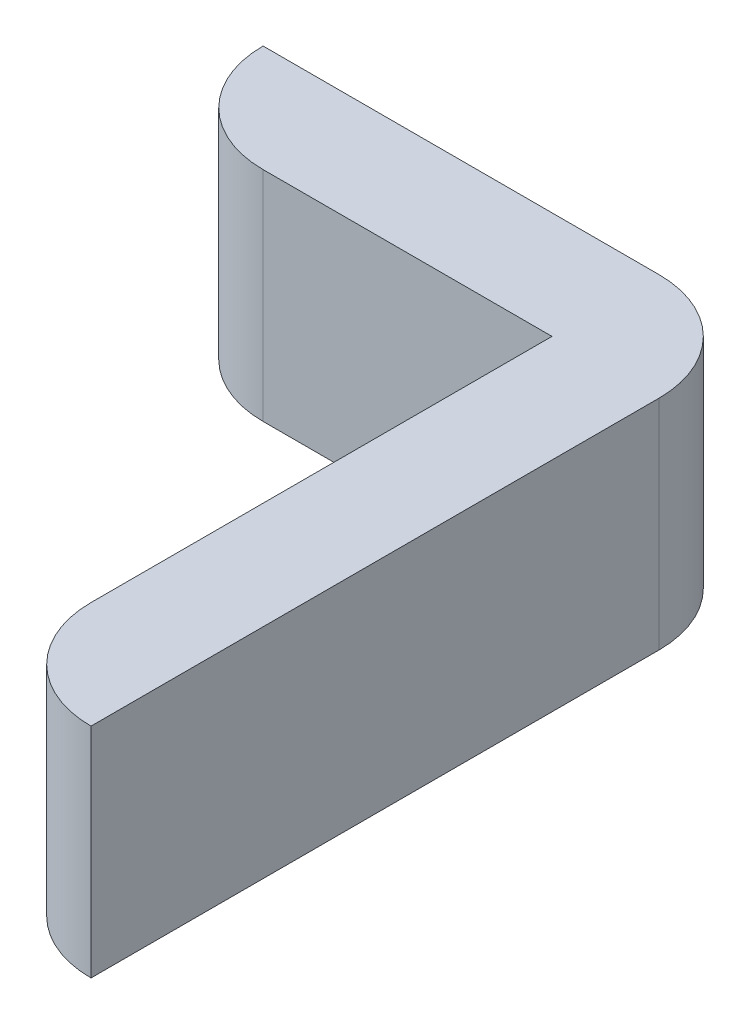
ISO-10303-21;
HEADER;
FILE_DESCRIPTION(('STEP AP214'),'2;1');
FILE_NAME('part.step','',(''),(''),'','','');
FILE_SCHEMA(('AUTOMOTIVE_DESIGN { 1 0 10303 214 1 1 1 1 }'));
ENDSEC;
DATA;
#1=APPLICATION_CONTEXT('core data for automotive mechanical design processes');
#2=APPLICATION_PROTOCOL_DEFINITION('international standard','automotive_design',2000,#1);
#3=PRODUCT_CONTEXT('',#1,'mechanical');
#4=PRODUCT('Part','Part','',(#3));
#5=PRODUCT_RELATED_PRODUCT_CATEGORY('part','',(#4));
#6=PRODUCT_DEFINITION_FORMATION('','',#4);
#7=PRODUCT_DEFINITION_CONTEXT('part definition',#1,'design');
#8=PRODUCT_DEFINITION('design','',#6,#7);
#9=PRODUCT_DEFINITION_SHAPE('','',#8);
#10=(LENGTH_UNIT() NAMED_UNIT(*) SI_UNIT(.MILLI.,.METRE.));
#11=(NAMED_UNIT(*) PLANE_ANGLE_UNIT() SI_UNIT($,.RADIAN.));
#12=(NAMED_UNIT(*) SI_UNIT($,.STERADIAN.) SOLID_ANGLE_UNIT());
#13=UNCERTAINTY_MEASURE_WITH_UNIT(LENGTH_MEASURE(1.E-05),#10,'distance_accuracy_value','');
#14=(GEOMETRIC_REPRESENTATION_CONTEXT(3) GLOBAL_UNCERTAINTY_ASSIGNED_CONTEXT((#13)) GLOBAL_UNIT_ASSIGNED_CONTEXT((#10,
#11,#12)) REPRESENTATION_CONTEXT('',''));
#15=CARTESIAN_POINT('',(0.,0.,0.));
#16=DIRECTION('',(0.,0.,1.));
#17=DIRECTION('',(1.,0.,0.));
#18=AXIS2_PLACEMENT_3D('',#15,#16,#17);
#19=CARTESIAN_POINT('',(-0.125,7.8748,0.));
#20=DIRECTION('',(0.,-1.,0.));
#21=DIRECTION('',(0.,0.,-1.));
#22=AXIS2_PLACEMENT_3D('',#19,#20,#21);
#23=PLANE('',#22);
#24=DIRECTION('',(-1.,0.,0.));
#25=VECTOR('',#24,1.);
#26=CARTESIAN_POINT('',(0.125,7.8748,0.25));
#27=LINE('',#26,#25);
#28=CARTESIAN_POINT('',(0.125,7.8748,0.25));
#29=VERTEX_POINT('',#28);
#30=CARTESIAN_POINT('',(0.8,7.8748,0.25));
#31=VERTEX_POINT('',#30);
#32=EDGE_CURVE('E102',#29,#31,#27,.F.);
#33=ORIENTED_EDGE('',*,*,#32,.T.);
#34=DIRECTION('',(0.,0.,-1.));
#35=VECTOR('',#34,1.);
#36=CARTESIAN_POINT('',(0.8,7.8748,0.25));
#37=LINE('',#36,#35);
#38=CARTESIAN_POINT('',(0.8,7.8748,1.327));
#39=VERTEX_POINT('',#38);
#40=EDGE_CURVE('E108',#31,#39,#37,.F.);
#41=ORIENTED_EDGE('',*,*,#40,.T.);
#42=CARTESIAN_POINT('',(1.05,7.8748,1.327));
#43=DIRECTION('',(0.,-1.,0.));
#44=DIRECTION('',(0.,0.,-1.));
#45=AXIS2_PLACEMENT_3D('',#42,#43,#44);
#46=CIRCLE('',#45,0.25);
#47=CARTESIAN_POINT('',(1.05,7.8748,1.577));
#48=VERTEX_POINT('',#47);
#49=EDGE_CURVE('E80',#48,#39,#46,.T.);
#50=ORIENTED_EDGE('',*,*,#49,.F.);
#51=DIRECTION('',(0.,0.,1.));
#52=VECTOR('',#51,1.);
#53=CARTESIAN_POINT('',(1.05,7.8748,1.577));
#54=LINE('',#53,#52);
#55=CARTESIAN_POINT('',(1.05,7.8748,0.25));
#56=VERTEX_POINT('',#55);
#57=EDGE_CURVE('E75',#48,#56,#54,.F.);
#58=ORIENTED_EDGE('',*,*,#57,.T.);
#59=CARTESIAN_POINT('',(0.8,7.8748,0.25));
#60=DIRECTION('',(0.,-1.,0.));
#61=DIRECTION('',(0.,0.,-1.));
#62=AXIS2_PLACEMENT_3D('',#59,#60,#61);
#63=CIRCLE('',#62,0.25);
#64=CARTESIAN_POINT('',(0.8,7.8748,0.));
#65=VERTEX_POINT('',#64);
#66=EDGE_CURVE('E19',#65,#56,#63,.T.);
#67=ORIENTED_EDGE('',*,*,#66,.F.);
#68=DIRECTION('',(1.,0.,0.));
#69=VECTOR('',#68,1.);
#70=CARTESIAN_POINT('',(0.8,7.8748,0.));
#71=LINE('',#70,#69);
#72=CARTESIAN_POINT('',(-0.125,7.8748,0.));
#73=VERTEX_POINT('',#72);
#74=EDGE_CURVE('E70',#65,#73,#71,.F.);
#75=ORIENTED_EDGE('',*,*,#74,.T.);
#76=CARTESIAN_POINT('',(0.125,7.8748,0.));
#77=DIRECTION('',(0.,-1.,0.));
#78=DIRECTION('',(0.,0.,-1.));
#79=AXIS2_PLACEMENT_3D('',#76,#77,#78);
#80=CIRCLE('',#79,0.25);
#81=EDGE_CURVE('E121',#29,#73,#80,.T.);
#82=ORIENTED_EDGE('',*,*,#81,.F.);
#83=EDGE_LOOP('',(#33,#41,#50,#58,#67,#75,#82));
#84=FACE_BOUND('',#83,.T.);
#85=ADVANCED_FACE('F16',(#84),#23,.F.);
#86=CARTESIAN_POINT('',(0.8,7.3652,0.));
#87=DIRECTION('',(0.,0.,1.));
#88=DIRECTION('',(1.,0.,0.));
#89=AXIS2_PLACEMENT_3D('',#86,#87,#88);
#90=PLANE('',#89);
#91=DIRECTION('',(0.,-1.,0.));
#92=VECTOR('',#91,1.);
#93=CARTESIAN_POINT('',(-0.125,7.3652,0.));
#94=LINE('',#93,#92);
#95=CARTESIAN_POINT('',(-0.125,7.3652,0.));
#96=VERTEX_POINT('',#95);
#97=EDGE_CURVE('E123',#73,#96,#94,.T.);
#98=ORIENTED_EDGE('',*,*,#97,.F.);
#99=ORIENTED_EDGE('',*,*,#74,.F.);
#100=DIRECTION('',(0.,-1.,0.));
#101=VECTOR('',#100,1.);
#102=CARTESIAN_POINT('',(0.8,7.3652,0.));
#103=LINE('',#102,#101);
#104=CARTESIAN_POINT('',(0.8,7.3652,0.));
#105=VERTEX_POINT('',#104);
#106=EDGE_CURVE('E92',#105,#65,#103,.F.);
#107=ORIENTED_EDGE('',*,*,#106,.F.);
#108=DIRECTION('',(1.,0.,0.));
#109=VECTOR('',#108,1.);
#110=CARTESIAN_POINT('',(-0.125,7.3652,0.));
#111=LINE('',#110,#109);
#112=EDGE_CURVE('E120',#96,#105,#111,.T.);
#113=ORIENTED_EDGE('',*,*,#112,.F.);
#114=EDGE_LOOP('',(#98,#99,#107,#113));
#115=FACE_BOUND('',#114,.T.);
#116=ADVANCED_FACE('F158',(#115),#90,.F.);
#117=CARTESIAN_POINT('',(0.8,7.3652,0.25));
#118=DIRECTION('',(0.,-1.,0.));
#119=DIRECTION('',(0.,0.,-1.));
#120=AXIS2_PLACEMENT_3D('',#117,#118,#119);
#121=CYLINDRICAL_SURFACE('',#120,0.25);
#122=ORIENTED_EDGE('',*,*,#66,.T.);
#123=DIRECTION('',(0.,1.,0.));
#124=VECTOR('',#123,1.);
#125=CARTESIAN_POINT('',(1.05,7.3652,0.25));
#126=LINE('',#125,#124);
#127=CARTESIAN_POINT('',(1.05,7.3652,0.25));
#128=VERTEX_POINT('',#127);
#129=EDGE_CURVE('E86',#56,#128,#126,.F.);
#130=ORIENTED_EDGE('',*,*,#129,.T.);
#131=CARTESIAN_POINT('',(0.8,7.3652,0.25));
#132=DIRECTION('',(0.,-1.,0.));
#133=DIRECTION('',(0.,0.,-1.));
#134=AXIS2_PLACEMENT_3D('',#131,#132,#133);
#135=CIRCLE('',#134,0.25);
#136=EDGE_CURVE('E118',#105,#128,#135,.T.);
#137=ORIENTED_EDGE('',*,*,#136,.F.);
#138=ORIENTED_EDGE('',*,*,#106,.T.);
#139=EDGE_LOOP('',(#122,#130,#137,#138));
#140=FACE_BOUND('',#139,.T.);
#141=ADVANCED_FACE('F89',(#140),#121,.T.);
#142=CARTESIAN_POINT('',(1.05,7.3652,1.577));
#143=DIRECTION('',(-1.,0.,0.));
#144=DIRECTION('',(0.,0.,1.));
#145=AXIS2_PLACEMENT_3D('',#142,#143,#144);
#146=PLANE('',#145);
#147=DIRECTION('',(0.,-1.,0.));
#148=VECTOR('',#147,1.);
#149=CARTESIAN_POINT('',(1.05,7.3652,1.577));
#150=LINE('',#149,#148);
#151=CARTESIAN_POINT('',(1.05,7.3652,1.577));
#152=VERTEX_POINT('',#151);
#153=EDGE_CURVE('E85',#152,#48,#150,.F.);
#154=ORIENTED_EDGE('',*,*,#153,.F.);
#155=DIRECTION('',(0.,0.,-1.));
#156=VECTOR('',#155,1.);
#157=CARTESIAN_POINT('',(1.05,7.3652,0.));
#158=LINE('',#157,#156);
#159=EDGE_CURVE('E94',#128,#152,#158,.F.);
#160=ORIENTED_EDGE('',*,*,#159,.F.);
#161=ORIENTED_EDGE('',*,*,#129,.F.);
#162=ORIENTED_EDGE('',*,*,#57,.F.);
#163=EDGE_LOOP('',(#154,#160,#161,#162));
#164=FACE_BOUND('',#163,.T.);
#165=ADVANCED_FACE('F93',(#164),#146,.F.);
#166=CARTESIAN_POINT('',(1.05,7.3652,1.327));
#167=DIRECTION('',(0.,-1.,0.));
#168=DIRECTION('',(0.,0.,-1.));
#169=AXIS2_PLACEMENT_3D('',#166,#167,#168);
#170=CYLINDRICAL_SURFACE('',#169,0.25);
#171=ORIENTED_EDGE('',*,*,#49,.T.);
#172=DIRECTION('',(0.,1.,0.));
#173=VECTOR('',#172,1.);
#174=CARTESIAN_POINT('',(0.8,7.3652,1.327));
#175=LINE('',#174,#173);
#176=CARTESIAN_POINT('',(0.8,7.3652,1.327));
#177=VERTEX_POINT('',#176);
#178=EDGE_CURVE('E105',#39,#177,#175,.F.);
#179=ORIENTED_EDGE('',*,*,#178,.T.);
#180=CARTESIAN_POINT('',(1.05,7.3652,1.327));
#181=DIRECTION('',(0.,-1.,0.));
#182=DIRECTION('',(0.,0.,-1.));
#183=AXIS2_PLACEMENT_3D('',#180,#181,#182);
#184=CIRCLE('',#183,0.25);
#185=EDGE_CURVE('E114',#152,#177,#184,.T.);
#186=ORIENTED_EDGE('',*,*,#185,.F.);
#187=ORIENTED_EDGE('',*,*,#153,.T.);
#188=EDGE_LOOP('',(#171,#179,#186,#187));
#189=FACE_BOUND('',#188,.T.);
#190=ADVANCED_FACE('F127',(#189),#170,.T.);
#191=CARTESIAN_POINT('',(0.8,7.3652,0.25));
#192=DIRECTION('',(1.,0.,0.));
#193=DIRECTION('',(0.,0.,-1.));
#194=AXIS2_PLACEMENT_3D('',#191,#192,#193);
#195=PLANE('',#194);
#196=ORIENTED_EDGE('',*,*,#178,.F.);
#197=ORIENTED_EDGE('',*,*,#40,.F.);
#198=DIRECTION('',(0.,1.,0.));
#199=VECTOR('',#198,1.);
#200=CARTESIAN_POINT('',(0.8,7.3652,0.25));
#201=LINE('',#200,#199);
#202=CARTESIAN_POINT('',(0.8,7.3652,0.25));
#203=VERTEX_POINT('',#202);
#204=EDGE_CURVE('E104',#31,#203,#201,.F.);
#205=ORIENTED_EDGE('',*,*,#204,.T.);
#206=DIRECTION('',(0.,0.,-1.));
#207=VECTOR('',#206,1.);
#208=CARTESIAN_POINT('',(0.8,7.3652,0.));
#209=LINE('',#208,#207);
#210=EDGE_CURVE('E117',#177,#203,#209,.T.);
#211=ORIENTED_EDGE('',*,*,#210,.F.);
#212=EDGE_LOOP('',(#196,#197,#205,#211));
#213=FACE_BOUND('',#212,.T.);
#214=ADVANCED_FACE('F150',(#213),#195,.F.);
#215=CARTESIAN_POINT('',(0.125,7.3652,0.25));
#216=DIRECTION('',(0.,0.,-1.));
#217=DIRECTION('',(-1.,0.,0.));
#218=AXIS2_PLACEMENT_3D('',#215,#216,#217);
#219=PLANE('',#218);
#220=ORIENTED_EDGE('',*,*,#204,.F.);
#221=ORIENTED_EDGE('',*,*,#32,.F.);
#222=DIRECTION('',(0.,-1.,0.));
#223=VECTOR('',#222,1.);
#224=CARTESIAN_POINT('',(0.125,7.3652,0.25));
#225=LINE('',#224,#223);
#226=CARTESIAN_POINT('',(0.125,7.3652,0.25));
#227=VERTEX_POINT('',#226);
#228=EDGE_CURVE('E34',#227,#29,#225,.F.);
#229=ORIENTED_EDGE('',*,*,#228,.F.);
#230=DIRECTION('',(1.,0.,0.));
#231=VECTOR('',#230,1.);
#232=CARTESIAN_POINT('',(-0.125,7.3652,0.25));
#233=LINE('',#232,#231);
#234=EDGE_CURVE('E25',#203,#227,#233,.F.);
#235=ORIENTED_EDGE('',*,*,#234,.F.);
#236=EDGE_LOOP('',(#220,#221,#229,#235));
#237=FACE_BOUND('',#236,.T.);
#238=ADVANCED_FACE('F151',(#237),#219,.F.);
#239=CARTESIAN_POINT('',(0.125,7.3652,0.));
#240=DIRECTION('',(0.,-1.,0.));
#241=DIRECTION('',(0.,0.,-1.));
#242=AXIS2_PLACEMENT_3D('',#239,#240,#241);
#243=CYLINDRICAL_SURFACE('',#242,0.25);
#244=ORIENTED_EDGE('',*,*,#81,.T.);
#245=ORIENTED_EDGE('',*,*,#97,.T.);
#246=CARTESIAN_POINT('',(0.125,7.3652,0.));
#247=DIRECTION('',(0.,-1.,0.));
#248=DIRECTION('',(0.,0.,-1.));
#249=AXIS2_PLACEMENT_3D('',#246,#247,#248);
#250=CIRCLE('',#249,0.25);
#251=EDGE_CURVE('E11',#227,#96,#250,.T.);
#252=ORIENTED_EDGE('',*,*,#251,.F.);
#253=ORIENTED_EDGE('',*,*,#228,.T.);
#254=EDGE_LOOP('',(#244,#245,#252,#253));
#255=FACE_BOUND('',#254,.T.);
#256=ADVANCED_FACE('F156',(#255),#243,.T.);
#257=CARTESIAN_POINT('',(-0.125,7.3652,0.));
#258=DIRECTION('',(0.,-1.,0.));
#259=DIRECTION('',(0.,0.,-1.));
#260=AXIS2_PLACEMENT_3D('',#257,#258,#259);
#261=PLANE('',#260);
#262=ORIENTED_EDGE('',*,*,#234,.T.);
#263=ORIENTED_EDGE('',*,*,#251,.T.);
#264=ORIENTED_EDGE('',*,*,#112,.T.);
#265=ORIENTED_EDGE('',*,*,#136,.T.);
#266=ORIENTED_EDGE('',*,*,#159,.T.);
#267=ORIENTED_EDGE('',*,*,#185,.T.);
#268=ORIENTED_EDGE('',*,*,#210,.T.);
#269=EDGE_LOOP('',(#262,#263,#264,#265,#266,#267,#268));
#270=FACE_BOUND('',#269,.T.);
#271=ADVANCED_FACE('F132',(#270),#261,.T.);
#272=CLOSED_SHELL('',(#85,#116,#141,#165,#190,#214,#238,#256,#271));
#273=MANIFOLD_SOLID_BREP('B1',#272);
#274=ADVANCED_BREP_SHAPE_REPRESENTATION('',(#18,#273),#14);
#275=SHAPE_DEFINITION_REPRESENTATION(#9,#274);
ENDSEC;
END-ISO-10303-21;
